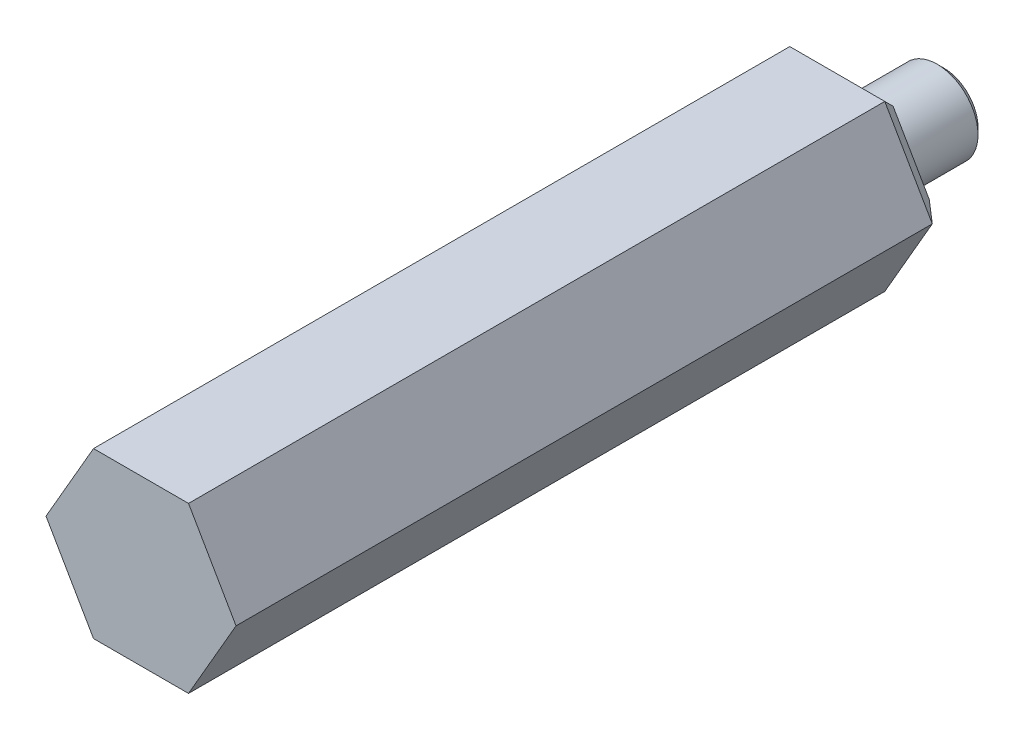
ISO-10303-21;
HEADER;
FILE_DESCRIPTION(('STEP AP214'),'2;1');
FILE_NAME('part.step','',(''),(''),'','','');
FILE_SCHEMA(('AUTOMOTIVE_DESIGN { 1 0 10303 214 1 1 1 1 }'));
ENDSEC;
DATA;
#1=APPLICATION_CONTEXT('core data for automotive mechanical design processes');
#2=APPLICATION_PROTOCOL_DEFINITION('international standard','automotive_design',2000,#1);
#3=PRODUCT_CONTEXT('',#1,'mechanical');
#4=PRODUCT('Part','Part','',(#3));
#5=PRODUCT_RELATED_PRODUCT_CATEGORY('part','',(#4));
#6=PRODUCT_DEFINITION_FORMATION('','',#4);
#7=PRODUCT_DEFINITION_CONTEXT('part definition',#1,'design');
#8=PRODUCT_DEFINITION('design','',#6,#7);
#9=PRODUCT_DEFINITION_SHAPE('','',#8);
#10=(LENGTH_UNIT() NAMED_UNIT(*) SI_UNIT(.MILLI.,.METRE.));
#11=(NAMED_UNIT(*) PLANE_ANGLE_UNIT() SI_UNIT($,.RADIAN.));
#12=(NAMED_UNIT(*) SI_UNIT($,.STERADIAN.) SOLID_ANGLE_UNIT());
#13=UNCERTAINTY_MEASURE_WITH_UNIT(LENGTH_MEASURE(1.E-05),#10,'distance_accuracy_value','');
#14=(GEOMETRIC_REPRESENTATION_CONTEXT(3) GLOBAL_UNCERTAINTY_ASSIGNED_CONTEXT((#13)) GLOBAL_UNIT_ASSIGNED_CONTEXT((#10,
#11,#12)) REPRESENTATION_CONTEXT('',''));
#15=CARTESIAN_POINT('',(0.,0.,0.));
#16=DIRECTION('',(0.,0.,1.));
#17=DIRECTION('',(1.,0.,0.));
#18=AXIS2_PLACEMENT_3D('',#15,#16,#17);
#19=CARTESIAN_POINT('',(7.366,0.,27.7495));
#20=DIRECTION('',(0.,0.,-1.));
#21=DIRECTION('',(-1.,0.,0.));
#22=AXIS2_PLACEMENT_3D('',#19,#20,#21);
#23=PLANE('',#22);
#24=DIRECTION('',(-0.5,0.866025403784439,0.));
#25=VECTOR('',#24,1.);
#26=CARTESIAN_POINT('',(5.5245,3.18957156213808,27.7495));
#27=LINE('',#26,#25);
#28=CARTESIAN_POINT('',(7.366,0.,27.7495));
#29=VERTEX_POINT('',#28);
#30=CARTESIAN_POINT('',(3.683,6.37914312427617,27.7495));
#31=VERTEX_POINT('',#30);
#32=EDGE_CURVE('E123',#29,#31,#27,.T.);
#33=ORIENTED_EDGE('',*,*,#32,.T.);
#34=DIRECTION('',(-1.,0.,0.));
#35=VECTOR('',#34,1.);
#36=CARTESIAN_POINT('',(0.,6.37914312427617,27.7495));
#37=LINE('',#36,#35);
#38=CARTESIAN_POINT('',(-3.68299999999998,6.37914312427617,27.7495));
#39=VERTEX_POINT('',#38);
#40=EDGE_CURVE('E135',#31,#39,#37,.T.);
#41=ORIENTED_EDGE('',*,*,#40,.T.);
#42=DIRECTION('',(-0.5,-0.866025403784439,0.));
#43=VECTOR('',#42,1.);
#44=CARTESIAN_POINT('',(-5.52449999999999,3.18957156213808,27.7495));
#45=LINE('',#44,#43);
#46=CARTESIAN_POINT('',(-7.36599999999998,0.,27.7495));
#47=VERTEX_POINT('',#46);
#48=EDGE_CURVE('E143',#39,#47,#45,.T.);
#49=ORIENTED_EDGE('',*,*,#48,.T.);
#50=DIRECTION('',(0.5,-0.866025403784439,0.));
#51=VECTOR('',#50,1.);
#52=CARTESIAN_POINT('',(-5.52449999999999,-3.18957156213808,27.7495));
#53=LINE('',#52,#51);
#54=CARTESIAN_POINT('',(-3.683,-6.37914312427616,27.7495));
#55=VERTEX_POINT('',#54);
#56=EDGE_CURVE('E211',#47,#55,#53,.T.);
#57=ORIENTED_EDGE('',*,*,#56,.T.);
#58=DIRECTION('',(1.,0.,0.));
#59=VECTOR('',#58,1.);
#60=CARTESIAN_POINT('',(0.,-6.37914312427617,27.7495));
#61=LINE('',#60,#59);
#62=CARTESIAN_POINT('',(3.68299999999999,-6.37914312427618,27.7495));
#63=VERTEX_POINT('',#62);
#64=EDGE_CURVE('E210',#55,#63,#61,.T.);
#65=ORIENTED_EDGE('',*,*,#64,.T.);
#66=DIRECTION('',(0.5,0.866025403784438,0.));
#67=VECTOR('',#66,1.);
#68=CARTESIAN_POINT('',(5.5245,-3.18957156213809,27.7495));
#69=LINE('',#68,#67);
#70=EDGE_CURVE('E137',#63,#29,#69,.T.);
#71=ORIENTED_EDGE('',*,*,#70,.T.);
#72=EDGE_LOOP('',(#33,#41,#49,#57,#65,#71));
#73=FACE_BOUND('',#72,.T.);
#74=ADVANCED_FACE('F47',(#73),#23,.F.);
#75=CARTESIAN_POINT('',(7.366,0.,-27.7495));
#76=DIRECTION('',(0.,0.,1.));
#77=DIRECTION('',(1.,0.,0.));
#78=AXIS2_PLACEMENT_3D('',#75,#76,#77);
#79=PLANE('',#78);
#80=DIRECTION('',(1.,0.,0.));
#81=VECTOR('',#80,1.);
#82=CARTESIAN_POINT('',(3.683,4.85514312427617,-27.7495));
#83=LINE('',#82,#81);
#84=CARTESIAN_POINT('',(-2.80311818975501,4.85514312427617,-27.7495));
#85=VERTEX_POINT('',#84);
#86=CARTESIAN_POINT('',(2.80311818975501,4.85514312427617,-27.7495));
#87=VERTEX_POINT('',#86);
#88=EDGE_CURVE('E155',#85,#87,#83,.T.);
#89=ORIENTED_EDGE('',*,*,#88,.T.);
#90=DIRECTION('',(0.5,-0.866025403784439,0.));
#91=VECTOR('',#90,1.);
#92=CARTESIAN_POINT('',(6.04617728463251,-0.761999999999998,-27.7495));
#93=LINE('',#92,#91);
#94=CARTESIAN_POINT('',(5.60623637951002,0.,-27.7495));
#95=VERTEX_POINT('',#94);
#96=EDGE_CURVE('E165',#87,#95,#93,.T.);
#97=ORIENTED_EDGE('',*,*,#96,.T.);
#98=DIRECTION('',(-0.5,-0.866025403784439,0.));
#99=VECTOR('',#98,1.);
#100=CARTESIAN_POINT('',(2.36317728463251,-5.61714312427618,-27.7495));
#101=LINE('',#100,#99);
#102=CARTESIAN_POINT('',(2.80311818975501,-4.85514312427617,-27.7495));
#103=VERTEX_POINT('',#102);
#104=EDGE_CURVE('E163',#95,#103,#101,.T.);
#105=ORIENTED_EDGE('',*,*,#104,.T.);
#106=DIRECTION('',(-1.,0.,0.));
#107=VECTOR('',#106,1.);
#108=CARTESIAN_POINT('',(-3.683,-4.85514312427617,-27.7495));
#109=LINE('',#108,#107);
#110=CARTESIAN_POINT('',(-2.80311818975501,-4.85514312427617,-27.7495));
#111=VERTEX_POINT('',#110);
#112=EDGE_CURVE('E161',#103,#111,#109,.T.);
#113=ORIENTED_EDGE('',*,*,#112,.T.);
#114=DIRECTION('',(-0.5,0.866025403784439,0.));
#115=VECTOR('',#114,1.);
#116=CARTESIAN_POINT('',(-6.04617728463252,0.762000000000006,-27.7495));
#117=LINE('',#116,#115);
#118=CARTESIAN_POINT('',(-5.60623637951002,0.,-27.7495));
#119=VERTEX_POINT('',#118);
#120=EDGE_CURVE('E159',#111,#119,#117,.T.);
#121=ORIENTED_EDGE('',*,*,#120,.T.);
#122=DIRECTION('',(0.5,0.866025403784439,0.));
#123=VECTOR('',#122,1.);
#124=CARTESIAN_POINT('',(-2.36317728463251,5.61714312427618,-27.7495));
#125=LINE('',#124,#123);
#126=EDGE_CURVE('E157',#119,#85,#125,.T.);
#127=ORIENTED_EDGE('',*,*,#126,.T.);
#128=EDGE_LOOP('',(#89,#97,#105,#113,#121,#127));
#129=FACE_BOUND('',#128,.T.);
#130=CARTESIAN_POINT('',(0.,0.,-27.7495));
#131=DIRECTION('',(0.,0.,-1.));
#132=DIRECTION('',(-1.,0.,0.));
#133=AXIS2_PLACEMENT_3D('',#130,#131,#132);
#134=CIRCLE('',#133,3.1623);
#135=CARTESIAN_POINT('',(-3.1623,0.,-27.7495));
#136=VERTEX_POINT('',#135);
#137=EDGE_CURVE('E128',#136,#136,#134,.T.);
#138=ORIENTED_EDGE('',*,*,#137,.F.);
#139=EDGE_LOOP('',(#138));
#140=FACE_BOUND('',#139,.T.);
#141=ADVANCED_FACE('F232',(#129,#140),#79,.F.);
#142=CARTESIAN_POINT('',(0.,0.,-34.4805));
#143=DIRECTION('',(0.,0.,-1.));
#144=DIRECTION('',(-1.,0.,0.));
#145=AXIS2_PLACEMENT_3D('',#142,#143,#144);
#146=CYLINDRICAL_SURFACE('',#145,3.1623);
#147=CARTESIAN_POINT('',(0.,0.,-33.97248635));
#148=DIRECTION('',(0.,0.,1.));
#149=DIRECTION('',(1.,0.,0.));
#150=AXIS2_PLACEMENT_3D('',#147,#148,#149);
#151=CIRCLE('',#150,3.1623);
#152=CARTESIAN_POINT('',(3.1623,0.,-33.97248635));
#153=VERTEX_POINT('',#152);
#154=EDGE_CURVE('E152',#153,#153,#151,.T.);
#155=ORIENTED_EDGE('',*,*,#154,.T.);
#156=EDGE_LOOP('',(#155));
#157=FACE_BOUND('',#156,.T.);
#158=ORIENTED_EDGE('',*,*,#137,.T.);
#159=EDGE_LOOP('',(#158));
#160=FACE_BOUND('',#159,.T.);
#161=ADVANCED_FACE('F251',(#157,#160),#146,.T.);
#162=CARTESIAN_POINT('',(3.1623,0.,-34.4805));
#163=DIRECTION('',(0.,0.,1.));
#164=DIRECTION('',(1.,0.,0.));
#165=AXIS2_PLACEMENT_3D('',#162,#163,#164);
#166=PLANE('',#165);
#167=CARTESIAN_POINT('',(0.,0.,-34.4805));
#168=DIRECTION('',(0.,0.,1.));
#169=DIRECTION('',(1.,0.,0.));
#170=AXIS2_PLACEMENT_3D('',#167,#168,#169);
#171=CIRCLE('',#170,2.65428634999999);
#172=CARTESIAN_POINT('',(2.65428634999999,0.,-34.4805));
#173=VERTEX_POINT('',#172);
#174=EDGE_CURVE('E149',#173,#173,#171,.F.);
#175=ORIENTED_EDGE('',*,*,#174,.T.);
#176=EDGE_LOOP('',(#175));
#177=FACE_BOUND('',#176,.T.);
#178=ADVANCED_FACE('F258',(#177),#166,.F.);
#179=CARTESIAN_POINT('',(0.,0.,-34.4805));
#180=DIRECTION('',(0.,0.,1.));
#181=DIRECTION('',(1.,0.,0.));
#182=AXIS2_PLACEMENT_3D('',#179,#180,#181);
#183=CONICAL_SURFACE('',#182,2.65428634999999,0.785398163397442);
#184=ORIENTED_EDGE('',*,*,#154,.F.);
#185=EDGE_LOOP('',(#184));
#186=FACE_BOUND('',#185,.T.);
#187=ORIENTED_EDGE('',*,*,#174,.F.);
#188=EDGE_LOOP('',(#187));
#189=FACE_BOUND('',#188,.T.);
#190=ADVANCED_FACE('F255',(#186,#189),#183,.T.);
#191=CARTESIAN_POINT('',(0.,6.37914312427617,27.7505));
#192=DIRECTION('',(0.,1.,0.));
#193=DIRECTION('',(0.,0.,1.));
#194=AXIS2_PLACEMENT_3D('',#191,#192,#193);
#195=PLANE('',#194);
#196=DIRECTION('',(0.,0.,-1.));
#197=VECTOR('',#196,1.);
#198=CARTESIAN_POINT('',(3.683,6.37914312427617,27.7505));
#199=LINE('',#198,#197);
#200=CARTESIAN_POINT('',(3.683,6.37914312427617,-26.2255));
#201=VERTEX_POINT('',#200);
#202=EDGE_CURVE('E119',#31,#201,#199,.T.);
#203=ORIENTED_EDGE('',*,*,#202,.T.);
#204=DIRECTION('',(-1.,0.,0.));
#205=VECTOR('',#204,1.);
#206=CARTESIAN_POINT('',(-3.68299999999999,6.37914312427617,-26.2255));
#207=LINE('',#206,#205);
#208=CARTESIAN_POINT('',(-3.68299999999999,6.37914312427618,-26.2255));
#209=VERTEX_POINT('',#208);
#210=EDGE_CURVE('E12',#201,#209,#207,.T.);
#211=ORIENTED_EDGE('',*,*,#210,.T.);
#212=DIRECTION('',(0.,0.,-1.));
#213=VECTOR('',#212,1.);
#214=CARTESIAN_POINT('',(-3.68299999999999,6.37914312427618,27.7505));
#215=LINE('',#214,#213);
#216=EDGE_CURVE('E129',#39,#209,#215,.T.);
#217=ORIENTED_EDGE('',*,*,#216,.F.);
#218=ORIENTED_EDGE('',*,*,#40,.F.);
#219=EDGE_LOOP('',(#203,#211,#217,#218));
#220=FACE_BOUND('',#219,.T.);
#221=ADVANCED_FACE('F139',(#220),#195,.T.);
#222=CARTESIAN_POINT('',(-5.52449999999999,3.18957156213808,27.7505));
#223=DIRECTION('',(-0.866025403784439,0.5,0.));
#224=DIRECTION('',(-0.5,-0.866025403784439,0.));
#225=AXIS2_PLACEMENT_3D('',#222,#223,#224);
#226=PLANE('',#225);
#227=ORIENTED_EDGE('',*,*,#216,.T.);
#228=DIRECTION('',(-0.5,-0.866025403784439,0.));
#229=VECTOR('',#228,1.);
#230=CARTESIAN_POINT('',(-7.36599999999999,0.,-26.2255));
#231=LINE('',#230,#229);
#232=CARTESIAN_POINT('',(-7.366,0.,-26.2255));
#233=VERTEX_POINT('',#232);
#234=EDGE_CURVE('E56',#209,#233,#231,.T.);
#235=ORIENTED_EDGE('',*,*,#234,.T.);
#236=DIRECTION('',(0.,0.,-1.));
#237=VECTOR('',#236,1.);
#238=CARTESIAN_POINT('',(-7.366,0.,27.7505));
#239=LINE('',#238,#237);
#240=EDGE_CURVE('E140',#47,#233,#239,.T.);
#241=ORIENTED_EDGE('',*,*,#240,.F.);
#242=ORIENTED_EDGE('',*,*,#48,.F.);
#243=EDGE_LOOP('',(#227,#235,#241,#242));
#244=FACE_BOUND('',#243,.T.);
#245=ADVANCED_FACE('F325',(#244),#226,.T.);
#246=CARTESIAN_POINT('',(-5.52449999999999,-3.18957156213808,27.7505));
#247=DIRECTION('',(-0.866025403784439,-0.5,0.));
#248=DIRECTION('',(0.5,-0.866025403784439,0.));
#249=AXIS2_PLACEMENT_3D('',#246,#247,#248);
#250=PLANE('',#249);
#251=ORIENTED_EDGE('',*,*,#240,.T.);
#252=DIRECTION('',(0.5,-0.866025403784439,0.));
#253=VECTOR('',#252,1.);
#254=CARTESIAN_POINT('',(-3.683,-6.37914312427617,-26.2255));
#255=LINE('',#254,#253);
#256=CARTESIAN_POINT('',(-3.683,-6.37914312427617,-26.2255));
#257=VERTEX_POINT('',#256);
#258=EDGE_CURVE('E173',#233,#257,#255,.T.);
#259=ORIENTED_EDGE('',*,*,#258,.T.);
#260=DIRECTION('',(0.,0.,-1.));
#261=VECTOR('',#260,1.);
#262=CARTESIAN_POINT('',(-3.683,-6.37914312427617,27.7505));
#263=LINE('',#262,#261);
#264=EDGE_CURVE('E204',#55,#257,#263,.T.);
#265=ORIENTED_EDGE('',*,*,#264,.F.);
#266=ORIENTED_EDGE('',*,*,#56,.F.);
#267=EDGE_LOOP('',(#251,#259,#265,#266));
#268=FACE_BOUND('',#267,.T.);
#269=ADVANCED_FACE('F203',(#268),#250,.T.);
#270=CARTESIAN_POINT('',(0.,-6.37914312427617,27.7505));
#271=DIRECTION('',(0.,-1.,0.));
#272=DIRECTION('',(0.,0.,-1.));
#273=AXIS2_PLACEMENT_3D('',#270,#271,#272);
#274=PLANE('',#273);
#275=ORIENTED_EDGE('',*,*,#264,.T.);
#276=DIRECTION('',(1.,0.,0.));
#277=VECTOR('',#276,1.);
#278=CARTESIAN_POINT('',(3.68299999999999,-6.37914312427617,-26.2255));
#279=LINE('',#278,#277);
#280=CARTESIAN_POINT('',(3.68299999999999,-6.37914312427618,-26.2255));
#281=VERTEX_POINT('',#280);
#282=EDGE_CURVE('E171',#257,#281,#279,.T.);
#283=ORIENTED_EDGE('',*,*,#282,.T.);
#284=DIRECTION('',(0.,0.,-1.));
#285=VECTOR('',#284,1.);
#286=CARTESIAN_POINT('',(3.68299999999999,-6.37914312427618,27.7505));
#287=LINE('',#286,#285);
#288=EDGE_CURVE('E213',#63,#281,#287,.T.);
#289=ORIENTED_EDGE('',*,*,#288,.F.);
#290=ORIENTED_EDGE('',*,*,#64,.F.);
#291=EDGE_LOOP('',(#275,#283,#289,#290));
#292=FACE_BOUND('',#291,.T.);
#293=ADVANCED_FACE('F207',(#292),#274,.T.);
#294=CARTESIAN_POINT('',(5.5245,-3.18957156213809,27.7505));
#295=DIRECTION('',(0.866025403784438,-0.5,0.));
#296=DIRECTION('',(0.5,0.866025403784438,0.));
#297=AXIS2_PLACEMENT_3D('',#294,#295,#296);
#298=PLANE('',#297);
#299=ORIENTED_EDGE('',*,*,#288,.T.);
#300=DIRECTION('',(0.5,0.866025403784438,0.));
#301=VECTOR('',#300,1.);
#302=CARTESIAN_POINT('',(7.366,0.,-26.2255));
#303=LINE('',#302,#301);
#304=CARTESIAN_POINT('',(7.366,0.,-26.2255));
#305=VERTEX_POINT('',#304);
#306=EDGE_CURVE('E169',#281,#305,#303,.T.);
#307=ORIENTED_EDGE('',*,*,#306,.T.);
#308=DIRECTION('',(0.,0.,-1.));
#309=VECTOR('',#308,1.);
#310=CARTESIAN_POINT('',(7.366,0.,27.7505));
#311=LINE('',#310,#309);
#312=EDGE_CURVE('E217',#29,#305,#311,.T.);
#313=ORIENTED_EDGE('',*,*,#312,.F.);
#314=ORIENTED_EDGE('',*,*,#70,.F.);
#315=EDGE_LOOP('',(#299,#307,#313,#314));
#316=FACE_BOUND('',#315,.T.);
#317=ADVANCED_FACE('F300',(#316),#298,.T.);
#318=CARTESIAN_POINT('',(5.5245,3.18957156213808,27.7505));
#319=DIRECTION('',(0.866025403784439,0.5,0.));
#320=DIRECTION('',(-0.5,0.866025403784439,0.));
#321=AXIS2_PLACEMENT_3D('',#318,#319,#320);
#322=PLANE('',#321);
#323=ORIENTED_EDGE('',*,*,#312,.T.);
#324=DIRECTION('',(-0.5,0.866025403784439,0.));
#325=VECTOR('',#324,1.);
#326=CARTESIAN_POINT('',(3.683,6.37914312427617,-26.2255));
#327=LINE('',#326,#325);
#328=EDGE_CURVE('E126',#305,#201,#327,.T.);
#329=ORIENTED_EDGE('',*,*,#328,.T.);
#330=ORIENTED_EDGE('',*,*,#202,.F.);
#331=ORIENTED_EDGE('',*,*,#32,.F.);
#332=EDGE_LOOP('',(#323,#329,#330,#331));
#333=FACE_BOUND('',#332,.T.);
#334=ADVANCED_FACE('F122',(#333),#322,.T.);
#335=CARTESIAN_POINT('',(-2.36317728463251,-5.61714312427617,-27.7495));
#336=DIRECTION('',(-0.612372435695796,-0.353553390593275,-0.707106781186545));
#337=DIRECTION('',(0.5,-0.866025403784439,0.));
#338=AXIS2_PLACEMENT_3D('',#335,#336,#337);
#339=PLANE('',#338);
#340=DIRECTION('',(-0.377964473009226,-0.654653670707976,0.654653670707979));
#341=VECTOR('',#340,1.);
#342=CARTESIAN_POINT('',(-2.92881559121858,-5.07285740999046,-27.5317857142857));
#343=LINE('',#342,#341);
#344=EDGE_CURVE('E185',#257,#111,#343,.F.);
#345=ORIENTED_EDGE('',*,*,#344,.F.);
#346=ORIENTED_EDGE('',*,*,#258,.F.);
#347=DIRECTION('',(-0.755928946018453,0.,0.654653670707979));
#348=VECTOR('',#347,1.);
#349=CARTESIAN_POINT('',(-3.75305975386574,0.,-29.3543980355075));
#350=LINE('',#349,#348);
#351=EDGE_CURVE('E51',#119,#233,#350,.T.);
#352=ORIENTED_EDGE('',*,*,#351,.F.);
#353=ORIENTED_EDGE('',*,*,#120,.F.);
#354=EDGE_LOOP('',(#345,#346,#352,#353));
#355=FACE_BOUND('',#354,.T.);
#356=ADVANCED_FACE('F49',(#355),#339,.T.);
#357=CARTESIAN_POINT('',(-2.36317728463251,5.61714312427617,-27.7495));
#358=DIRECTION('',(-0.612372435695796,0.353553390593275,-0.707106781186546));
#359=DIRECTION('',(-0.5,-0.866025403784439,0.));
#360=AXIS2_PLACEMENT_3D('',#357,#358,#359);
#361=PLANE('',#360);
#362=ORIENTED_EDGE('',*,*,#351,.T.);
#363=ORIENTED_EDGE('',*,*,#234,.F.);
#364=DIRECTION('',(-0.377964473009227,0.654653670707976,0.654653670707979));
#365=VECTOR('',#364,1.);
#366=CARTESIAN_POINT('',(-1.35038701979001,2.33893892815782,-30.2657041961184));
#367=LINE('',#366,#365);
#368=EDGE_CURVE('E183',#85,#209,#367,.T.);
#369=ORIENTED_EDGE('',*,*,#368,.F.);
#370=ORIENTED_EDGE('',*,*,#126,.F.);
#371=EDGE_LOOP('',(#362,#363,#369,#370));
#372=FACE_BOUND('',#371,.T.);
#373=ADVANCED_FACE('F195',(#372),#361,.T.);
#374=CARTESIAN_POINT('',(7.366,-4.85514312427617,-27.7495));
#375=DIRECTION('',(0.,-0.707106781186549,-0.707106781186546));
#376=DIRECTION('',(1.,0.,0.));
#377=AXIS2_PLACEMENT_3D('',#374,#375,#376);
#378=PLANE('',#377);
#379=ORIENTED_EDGE('',*,*,#344,.T.);
#380=ORIENTED_EDGE('',*,*,#112,.F.);
#381=DIRECTION('',(0.377964473009226,-0.654653670707976,0.654653670707979));
#382=VECTOR('',#381,1.);
#383=CARTESIAN_POINT('',(3.45495844836143,-5.98416357060134,-26.6204795536748));
#384=LINE('',#383,#382);
#385=EDGE_CURVE('E180',#281,#103,#384,.F.);
#386=ORIENTED_EDGE('',*,*,#385,.F.);
#387=ORIENTED_EDGE('',*,*,#282,.F.);
#388=EDGE_LOOP('',(#379,#380,#386,#387));
#389=FACE_BOUND('',#388,.T.);
#390=ADVANCED_FACE('F238',(#389),#378,.T.);
#391=CARTESIAN_POINT('',(7.366,4.85514312427617,-27.7495));
#392=DIRECTION('',(0.,0.707106781186549,-0.707106781186546));
#393=DIRECTION('',(-1.,0.,0.));
#394=AXIS2_PLACEMENT_3D('',#391,#392,#393);
#395=PLANE('',#394);
#396=ORIENTED_EDGE('',*,*,#368,.T.);
#397=ORIENTED_EDGE('',*,*,#210,.F.);
#398=DIRECTION('',(-0.377964473009226,-0.654653670707976,-0.654653670707979));
#399=VECTOR('',#398,1.);
#400=CARTESIAN_POINT('',(3.45495844836143,5.98416357060134,-26.6204795536748));
#401=LINE('',#400,#399);
#402=EDGE_CURVE('E178',#87,#201,#401,.F.);
#403=ORIENTED_EDGE('',*,*,#402,.F.);
#404=ORIENTED_EDGE('',*,*,#88,.F.);
#405=EDGE_LOOP('',(#396,#397,#403,#404));
#406=FACE_BOUND('',#405,.T.);
#407=ADVANCED_FACE('F236',(#406),#395,.T.);
#408=CARTESIAN_POINT('',(6.04617728463252,0.762,-27.7495));
#409=DIRECTION('',(0.612372435695796,-0.353553390593275,-0.707106781186546));
#410=DIRECTION('',(0.5,0.866025403784438,0.));
#411=AXIS2_PLACEMENT_3D('',#408,#409,#410);
#412=PLANE('',#411);
#413=ORIENTED_EDGE('',*,*,#385,.T.);
#414=ORIENTED_EDGE('',*,*,#104,.F.);
#415=DIRECTION('',(0.755928946018453,0.,0.654653670707979));
#416=VECTOR('',#415,1.);
#417=CARTESIAN_POINT('',(5.85763118243716,0.,-27.5317857142857));
#418=LINE('',#417,#416);
#419=EDGE_CURVE('E176',#305,#95,#418,.F.);
#420=ORIENTED_EDGE('',*,*,#419,.F.);
#421=ORIENTED_EDGE('',*,*,#306,.F.);
#422=EDGE_LOOP('',(#413,#414,#420,#421));
#423=FACE_BOUND('',#422,.T.);
#424=ADVANCED_FACE('F229',(#423),#412,.T.);
#425=CARTESIAN_POINT('',(6.04617728463251,-0.762,-27.7495));
#426=DIRECTION('',(0.612372435695796,0.353553390593274,-0.707106781186546));
#427=DIRECTION('',(-0.5,0.866025403784439,0.));
#428=AXIS2_PLACEMENT_3D('',#425,#426,#427);
#429=PLANE('',#428);
#430=ORIENTED_EDGE('',*,*,#402,.T.);
#431=ORIENTED_EDGE('',*,*,#328,.F.);
#432=ORIENTED_EDGE('',*,*,#419,.T.);
#433=ORIENTED_EDGE('',*,*,#96,.F.);
#434=EDGE_LOOP('',(#430,#431,#432,#433));
#435=FACE_BOUND('',#434,.T.);
#436=ADVANCED_FACE('F223',(#435),#429,.T.);
#437=CLOSED_SHELL('',(#74,#141,#161,#178,#190,#221,#245,#269,#293,#317,#334,#356,#373,#390,#407,
#424,#436));
#438=MANIFOLD_SOLID_BREP('B2',#437);
#439=ADVANCED_BREP_SHAPE_REPRESENTATION('',(#18,#438),#14);
#440=SHAPE_DEFINITION_REPRESENTATION(#9,#439);
ENDSEC;
END-ISO-10303-21;
